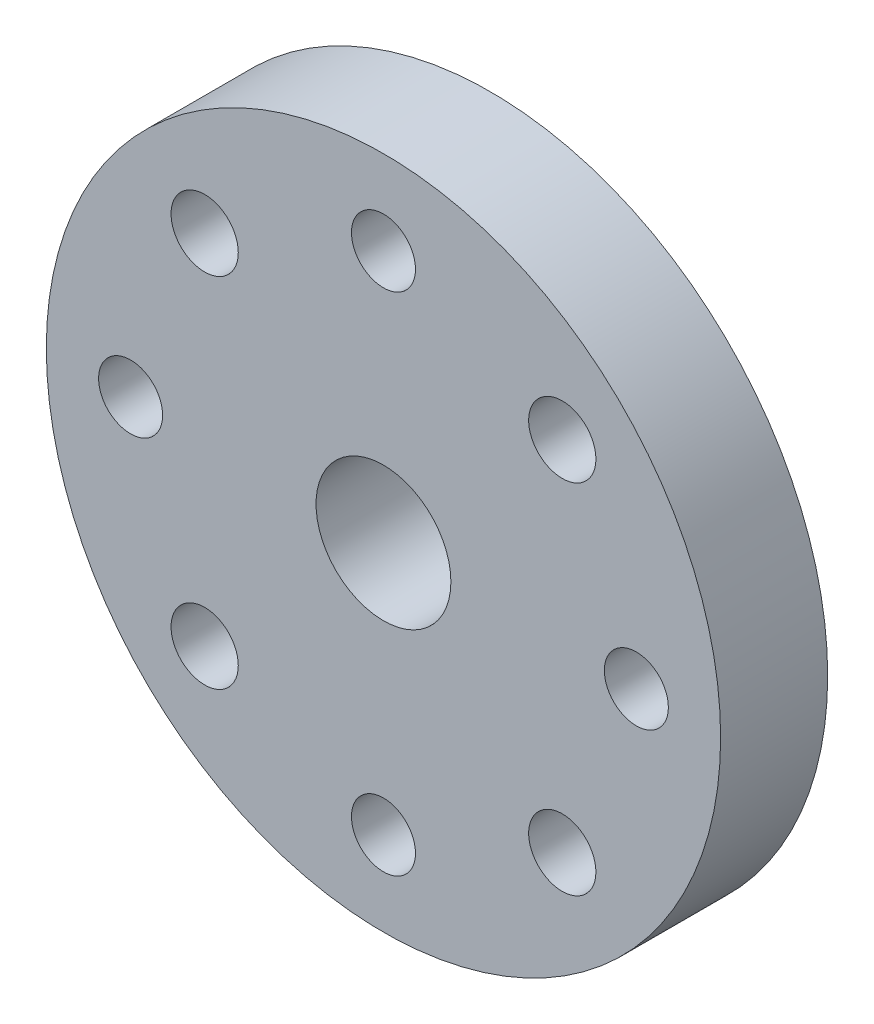
ISO-10303-21;
HEADER;
FILE_DESCRIPTION(('STEP AP214'),'2;1');
FILE_NAME('part.step','',(''),(''),'','','');
FILE_SCHEMA(('AUTOMOTIVE_DESIGN { 1 0 10303 214 1 1 1 1 }'));
ENDSEC;
DATA;
#1=APPLICATION_CONTEXT('core data for automotive mechanical design processes');
#2=APPLICATION_PROTOCOL_DEFINITION('international standard','automotive_design',2000,#1);
#3=PRODUCT_CONTEXT('',#1,'mechanical');
#4=PRODUCT('Part','Part','',(#3));
#5=PRODUCT_RELATED_PRODUCT_CATEGORY('part','',(#4));
#6=PRODUCT_DEFINITION_FORMATION('','',#4);
#7=PRODUCT_DEFINITION_CONTEXT('part definition',#1,'design');
#8=PRODUCT_DEFINITION('design','',#6,#7);
#9=PRODUCT_DEFINITION_SHAPE('','',#8);
#10=(LENGTH_UNIT() NAMED_UNIT(*) SI_UNIT(.MILLI.,.METRE.));
#11=(NAMED_UNIT(*) PLANE_ANGLE_UNIT() SI_UNIT($,.RADIAN.));
#12=(NAMED_UNIT(*) SI_UNIT($,.STERADIAN.) SOLID_ANGLE_UNIT());
#13=UNCERTAINTY_MEASURE_WITH_UNIT(LENGTH_MEASURE(1.E-05),#10,'distance_accuracy_value','');
#14=(GEOMETRIC_REPRESENTATION_CONTEXT(3) GLOBAL_UNCERTAINTY_ASSIGNED_CONTEXT((#13)) GLOBAL_UNIT_ASSIGNED_CONTEXT((#10,
#11,#12)) REPRESENTATION_CONTEXT('',''));
#15=CARTESIAN_POINT('',(0.,0.,0.));
#16=DIRECTION('',(0.,0.,1.));
#17=DIRECTION('',(1.,0.,0.));
#18=AXIS2_PLACEMENT_3D('',#15,#16,#17);
#19=CARTESIAN_POINT('',(0.,0.,6.35));
#20=DIRECTION('',(0.,0.,1.));
#21=DIRECTION('',(1.,0.,0.));
#22=AXIS2_PLACEMENT_3D('',#19,#20,#21);
#23=PLANE('',#22);
#24=CARTESIAN_POINT('',(-15.,1.57116660247941E-13,6.35));
#25=DIRECTION('',(0.,0.,1.));
#26=DIRECTION('',(1.,0.,0.));
#27=AXIS2_PLACEMENT_3D('',#24,#25,#26);
#28=CIRCLE('',#27,1.89865);
#29=CARTESIAN_POINT('',(-13.10135,1.57116660247941E-13,6.35));
#30=VERTEX_POINT('',#29);
#31=EDGE_CURVE('E85',#30,#30,#28,.T.);
#32=ORIENTED_EDGE('',*,*,#31,.F.);
#33=EDGE_LOOP('',(#32));
#34=FACE_BOUND('',#33,.T.);
#35=CARTESIAN_POINT('',(3.74802517533735E-13,-15.0000000000001,6.35));
#36=DIRECTION('',(0.,0.,1.));
#37=DIRECTION('',(1.,0.,0.));
#38=AXIS2_PLACEMENT_3D('',#35,#36,#37);
#39=CIRCLE('',#38,1.89865);
#40=CARTESIAN_POINT('',(1.89865000000037,-15.0000000000001,6.35));
#41=VERTEX_POINT('',#40);
#42=EDGE_CURVE('E73',#41,#41,#39,.T.);
#43=ORIENTED_EDGE('',*,*,#42,.F.);
#44=EDGE_LOOP('',(#43));
#45=FACE_BOUND('',#44,.T.);
#46=CARTESIAN_POINT('',(15.,0.,6.35));
#47=DIRECTION('',(0.,0.,1.));
#48=DIRECTION('',(1.,0.,0.));
#49=AXIS2_PLACEMENT_3D('',#46,#47,#48);
#50=CIRCLE('',#49,1.89865);
#51=CARTESIAN_POINT('',(16.89865,0.,6.35));
#52=VERTEX_POINT('',#51);
#53=EDGE_CURVE('E61',#52,#52,#50,.T.);
#54=ORIENTED_EDGE('',*,*,#53,.F.);
#55=EDGE_LOOP('',(#54));
#56=FACE_BOUND('',#55,.T.);
#57=CARTESIAN_POINT('',(0.,15.,6.35));
#58=DIRECTION('',(0.,0.,1.));
#59=DIRECTION('',(1.,0.,0.));
#60=AXIS2_PLACEMENT_3D('',#57,#58,#59);
#61=CIRCLE('',#60,1.89865);
#62=CARTESIAN_POINT('',(1.89865,15.,6.35));
#63=VERTEX_POINT('',#62);
#64=EDGE_CURVE('E49',#63,#63,#61,.T.);
#65=ORIENTED_EDGE('',*,*,#64,.F.);
#66=EDGE_LOOP('',(#65));
#67=FACE_BOUND('',#66,.T.);
#68=CARTESIAN_POINT('',(0.,0.,6.35));
#69=DIRECTION('',(0.,0.,1.));
#70=DIRECTION('',(1.,0.,0.));
#71=AXIS2_PLACEMENT_3D('',#68,#69,#70);
#72=CIRCLE('',#71,20.);
#73=CARTESIAN_POINT('',(20.,0.,6.35));
#74=VERTEX_POINT('',#73);
#75=EDGE_CURVE('E10',#74,#74,#72,.T.);
#76=ORIENTED_EDGE('',*,*,#75,.T.);
#77=EDGE_LOOP('',(#76));
#78=FACE_BOUND('',#77,.T.);
#79=CARTESIAN_POINT('',(0.,0.,6.35));
#80=DIRECTION('',(0.,0.,1.));
#81=DIRECTION('',(1.,0.,0.));
#82=AXIS2_PLACEMENT_3D('',#79,#80,#81);
#83=CIRCLE('',#82,4.);
#84=CARTESIAN_POINT('',(4.,0.,6.35));
#85=VERTEX_POINT('',#84);
#86=EDGE_CURVE('E44',#85,#85,#83,.T.);
#87=ORIENTED_EDGE('',*,*,#86,.F.);
#88=EDGE_LOOP('',(#87));
#89=FACE_BOUND('',#88,.T.);
#90=CARTESIAN_POINT('',(10.6066017177982,10.6066017177982,6.35));
#91=DIRECTION('',(0.,0.,1.));
#92=DIRECTION('',(1.,0.,0.));
#93=AXIS2_PLACEMENT_3D('',#90,#91,#92);
#94=CIRCLE('',#93,1.9939);
#95=CARTESIAN_POINT('',(12.6005017177982,10.6066017177982,6.35));
#96=VERTEX_POINT('',#95);
#97=EDGE_CURVE('E55',#96,#96,#94,.T.);
#98=ORIENTED_EDGE('',*,*,#97,.F.);
#99=EDGE_LOOP('',(#98));
#100=FACE_BOUND('',#99,.T.);
#101=CARTESIAN_POINT('',(10.6066017177982,-10.6066017177983,6.35));
#102=DIRECTION('',(0.,0.,1.));
#103=DIRECTION('',(1.,0.,0.));
#104=AXIS2_PLACEMENT_3D('',#101,#102,#103);
#105=CIRCLE('',#104,1.9939);
#106=CARTESIAN_POINT('',(12.6005017177982,-10.6066017177983,6.35));
#107=VERTEX_POINT('',#106);
#108=EDGE_CURVE('E67',#107,#107,#105,.T.);
#109=ORIENTED_EDGE('',*,*,#108,.F.);
#110=EDGE_LOOP('',(#109));
#111=FACE_BOUND('',#110,.T.);
#112=CARTESIAN_POINT('',(-10.6066017177979,-10.6066017177983,6.35));
#113=DIRECTION('',(0.,0.,1.));
#114=DIRECTION('',(1.,0.,0.));
#115=AXIS2_PLACEMENT_3D('',#112,#113,#114);
#116=CIRCLE('',#115,1.9939);
#117=CARTESIAN_POINT('',(-8.61270171779786,-10.6066017177983,6.35));
#118=VERTEX_POINT('',#117);
#119=EDGE_CURVE('E79',#118,#118,#116,.T.);
#120=ORIENTED_EDGE('',*,*,#119,.F.);
#121=EDGE_LOOP('',(#120));
#122=FACE_BOUND('',#121,.T.);
#123=CARTESIAN_POINT('',(-10.6066017177981,10.6066017177983,6.35));
#124=DIRECTION('',(0.,0.,1.));
#125=DIRECTION('',(1.,0.,0.));
#126=AXIS2_PLACEMENT_3D('',#123,#124,#125);
#127=CIRCLE('',#126,1.9939);
#128=CARTESIAN_POINT('',(-8.61270171779808,10.6066017177983,6.35));
#129=VERTEX_POINT('',#128);
#130=EDGE_CURVE('E91',#129,#129,#127,.T.);
#131=ORIENTED_EDGE('',*,*,#130,.F.);
#132=EDGE_LOOP('',(#131));
#133=FACE_BOUND('',#132,.T.);
#134=ADVANCED_FACE('F33',(#34,#45,#56,#67,#78,#89,#100,#111,#122,#133),#23,.T.);
#135=CARTESIAN_POINT('',(0.,0.,0.));
#136=DIRECTION('',(0.,0.,1.));
#137=DIRECTION('',(1.,0.,0.));
#138=AXIS2_PLACEMENT_3D('',#135,#136,#137);
#139=PLANE('',#138);
#140=CARTESIAN_POINT('',(0.,0.,0.));
#141=DIRECTION('',(0.,0.,1.));
#142=DIRECTION('',(1.,0.,0.));
#143=AXIS2_PLACEMENT_3D('',#140,#141,#142);
#144=CIRCLE('',#143,20.);
#145=CARTESIAN_POINT('',(20.,0.,0.));
#146=VERTEX_POINT('',#145);
#147=EDGE_CURVE('E37',#146,#146,#144,.T.);
#148=ORIENTED_EDGE('',*,*,#147,.F.);
#149=EDGE_LOOP('',(#148));
#150=FACE_BOUND('',#149,.T.);
#151=CARTESIAN_POINT('',(0.,0.,0.));
#152=DIRECTION('',(0.,0.,1.));
#153=DIRECTION('',(1.,0.,0.));
#154=AXIS2_PLACEMENT_3D('',#151,#152,#153);
#155=CIRCLE('',#154,4.);
#156=CARTESIAN_POINT('',(4.,0.,0.));
#157=VERTEX_POINT('',#156);
#158=EDGE_CURVE('E46',#157,#157,#155,.T.);
#159=ORIENTED_EDGE('',*,*,#158,.T.);
#160=EDGE_LOOP('',(#159));
#161=FACE_BOUND('',#160,.T.);
#162=CARTESIAN_POINT('',(0.,15.,0.));
#163=DIRECTION('',(0.,0.,1.));
#164=DIRECTION('',(1.,0.,0.));
#165=AXIS2_PLACEMENT_3D('',#162,#163,#164);
#166=CIRCLE('',#165,1.89865);
#167=CARTESIAN_POINT('',(1.89865,15.,0.));
#168=VERTEX_POINT('',#167);
#169=EDGE_CURVE('E52',#168,#168,#166,.T.);
#170=ORIENTED_EDGE('',*,*,#169,.T.);
#171=EDGE_LOOP('',(#170));
#172=FACE_BOUND('',#171,.T.);
#173=CARTESIAN_POINT('',(10.6066017177982,10.6066017177982,0.));
#174=DIRECTION('',(0.,0.,1.));
#175=DIRECTION('',(1.,0.,0.));
#176=AXIS2_PLACEMENT_3D('',#173,#174,#175);
#177=CIRCLE('',#176,1.9939);
#178=CARTESIAN_POINT('',(12.6005017177982,10.6066017177982,0.));
#179=VERTEX_POINT('',#178);
#180=EDGE_CURVE('E58',#179,#179,#177,.T.);
#181=ORIENTED_EDGE('',*,*,#180,.T.);
#182=EDGE_LOOP('',(#181));
#183=FACE_BOUND('',#182,.T.);
#184=CARTESIAN_POINT('',(15.,0.,0.));
#185=DIRECTION('',(0.,0.,1.));
#186=DIRECTION('',(1.,0.,0.));
#187=AXIS2_PLACEMENT_3D('',#184,#185,#186);
#188=CIRCLE('',#187,1.89865);
#189=CARTESIAN_POINT('',(16.89865,0.,0.));
#190=VERTEX_POINT('',#189);
#191=EDGE_CURVE('E64',#190,#190,#188,.T.);
#192=ORIENTED_EDGE('',*,*,#191,.T.);
#193=EDGE_LOOP('',(#192));
#194=FACE_BOUND('',#193,.T.);
#195=CARTESIAN_POINT('',(10.6066017177982,-10.6066017177983,0.));
#196=DIRECTION('',(0.,0.,1.));
#197=DIRECTION('',(1.,0.,0.));
#198=AXIS2_PLACEMENT_3D('',#195,#196,#197);
#199=CIRCLE('',#198,1.9939);
#200=CARTESIAN_POINT('',(12.6005017177982,-10.6066017177983,0.));
#201=VERTEX_POINT('',#200);
#202=EDGE_CURVE('E70',#201,#201,#199,.T.);
#203=ORIENTED_EDGE('',*,*,#202,.T.);
#204=EDGE_LOOP('',(#203));
#205=FACE_BOUND('',#204,.T.);
#206=CARTESIAN_POINT('',(3.74802517533735E-13,-15.0000000000001,0.));
#207=DIRECTION('',(0.,0.,1.));
#208=DIRECTION('',(1.,0.,0.));
#209=AXIS2_PLACEMENT_3D('',#206,#207,#208);
#210=CIRCLE('',#209,1.89865);
#211=CARTESIAN_POINT('',(1.89865000000037,-15.0000000000001,0.));
#212=VERTEX_POINT('',#211);
#213=EDGE_CURVE('E76',#212,#212,#210,.T.);
#214=ORIENTED_EDGE('',*,*,#213,.T.);
#215=EDGE_LOOP('',(#214));
#216=FACE_BOUND('',#215,.T.);
#217=CARTESIAN_POINT('',(-10.6066017177979,-10.6066017177983,0.));
#218=DIRECTION('',(0.,0.,1.));
#219=DIRECTION('',(1.,0.,0.));
#220=AXIS2_PLACEMENT_3D('',#217,#218,#219);
#221=CIRCLE('',#220,1.9939);
#222=CARTESIAN_POINT('',(-8.61270171779786,-10.6066017177983,0.));
#223=VERTEX_POINT('',#222);
#224=EDGE_CURVE('E82',#223,#223,#221,.T.);
#225=ORIENTED_EDGE('',*,*,#224,.T.);
#226=EDGE_LOOP('',(#225));
#227=FACE_BOUND('',#226,.T.);
#228=CARTESIAN_POINT('',(-15.,1.57116660247941E-13,0.));
#229=DIRECTION('',(0.,0.,1.));
#230=DIRECTION('',(1.,0.,0.));
#231=AXIS2_PLACEMENT_3D('',#228,#229,#230);
#232=CIRCLE('',#231,1.89865);
#233=CARTESIAN_POINT('',(-13.10135,1.57116660247941E-13,0.));
#234=VERTEX_POINT('',#233);
#235=EDGE_CURVE('E88',#234,#234,#232,.T.);
#236=ORIENTED_EDGE('',*,*,#235,.T.);
#237=EDGE_LOOP('',(#236));
#238=FACE_BOUND('',#237,.T.);
#239=CARTESIAN_POINT('',(-10.6066017177981,10.6066017177983,0.));
#240=DIRECTION('',(0.,0.,1.));
#241=DIRECTION('',(1.,0.,0.));
#242=AXIS2_PLACEMENT_3D('',#239,#240,#241);
#243=CIRCLE('',#242,1.9939);
#244=CARTESIAN_POINT('',(-8.61270171779808,10.6066017177983,0.));
#245=VERTEX_POINT('',#244);
#246=EDGE_CURVE('E94',#245,#245,#243,.T.);
#247=ORIENTED_EDGE('',*,*,#246,.T.);
#248=EDGE_LOOP('',(#247));
#249=FACE_BOUND('',#248,.T.);
#250=ADVANCED_FACE('F104',(#150,#161,#172,#183,#194,#205,#216,#227,#238,#249),#139,.F.);
#251=CARTESIAN_POINT('',(0.,0.,6.35));
#252=DIRECTION('',(0.,0.,-1.));
#253=DIRECTION('',(-1.,0.,0.));
#254=AXIS2_PLACEMENT_3D('',#251,#252,#253);
#255=CYLINDRICAL_SURFACE('',#254,20.);
#256=ORIENTED_EDGE('',*,*,#75,.F.);
#257=EDGE_LOOP('',(#256));
#258=FACE_BOUND('',#257,.T.);
#259=ORIENTED_EDGE('',*,*,#147,.T.);
#260=EDGE_LOOP('',(#259));
#261=FACE_BOUND('',#260,.T.);
#262=ADVANCED_FACE('F35',(#258,#261),#255,.T.);
#263=CARTESIAN_POINT('',(0.,0.,6.35));
#264=DIRECTION('',(0.,0.,-1.));
#265=DIRECTION('',(-1.,0.,0.));
#266=AXIS2_PLACEMENT_3D('',#263,#264,#265);
#267=CYLINDRICAL_SURFACE('',#266,4.);
#268=ORIENTED_EDGE('',*,*,#86,.T.);
#269=EDGE_LOOP('',(#268));
#270=FACE_BOUND('',#269,.T.);
#271=ORIENTED_EDGE('',*,*,#158,.F.);
#272=EDGE_LOOP('',(#271));
#273=FACE_BOUND('',#272,.T.);
#274=ADVANCED_FACE('F114',(#270,#273),#267,.F.);
#275=CARTESIAN_POINT('',(0.,15.,6.35));
#276=DIRECTION('',(0.,0.,-1.));
#277=DIRECTION('',(-1.,0.,0.));
#278=AXIS2_PLACEMENT_3D('',#275,#276,#277);
#279=CYLINDRICAL_SURFACE('',#278,1.89865);
#280=ORIENTED_EDGE('',*,*,#64,.T.);
#281=EDGE_LOOP('',(#280));
#282=FACE_BOUND('',#281,.T.);
#283=ORIENTED_EDGE('',*,*,#169,.F.);
#284=EDGE_LOOP('',(#283));
#285=FACE_BOUND('',#284,.T.);
#286=ADVANCED_FACE('F117',(#282,#285),#279,.F.);
#287=CARTESIAN_POINT('',(10.6066017177982,10.6066017177982,6.35));
#288=DIRECTION('',(0.,0.,-1.));
#289=DIRECTION('',(-1.,0.,0.));
#290=AXIS2_PLACEMENT_3D('',#287,#288,#289);
#291=CYLINDRICAL_SURFACE('',#290,1.9939);
#292=ORIENTED_EDGE('',*,*,#97,.T.);
#293=EDGE_LOOP('',(#292));
#294=FACE_BOUND('',#293,.T.);
#295=ORIENTED_EDGE('',*,*,#180,.F.);
#296=EDGE_LOOP('',(#295));
#297=FACE_BOUND('',#296,.T.);
#298=ADVANCED_FACE('F121',(#294,#297),#291,.F.);
#299=CARTESIAN_POINT('',(15.,0.,6.35));
#300=DIRECTION('',(0.,0.,-1.));
#301=DIRECTION('',(-1.,0.,0.));
#302=AXIS2_PLACEMENT_3D('',#299,#300,#301);
#303=CYLINDRICAL_SURFACE('',#302,1.89865);
#304=ORIENTED_EDGE('',*,*,#53,.T.);
#305=EDGE_LOOP('',(#304));
#306=FACE_BOUND('',#305,.T.);
#307=ORIENTED_EDGE('',*,*,#191,.F.);
#308=EDGE_LOOP('',(#307));
#309=FACE_BOUND('',#308,.T.);
#310=ADVANCED_FACE('F125',(#306,#309),#303,.F.);
#311=CARTESIAN_POINT('',(10.6066017177982,-10.6066017177983,6.35));
#312=DIRECTION('',(0.,0.,-1.));
#313=DIRECTION('',(-1.,0.,0.));
#314=AXIS2_PLACEMENT_3D('',#311,#312,#313);
#315=CYLINDRICAL_SURFACE('',#314,1.9939);
#316=ORIENTED_EDGE('',*,*,#108,.T.);
#317=EDGE_LOOP('',(#316));
#318=FACE_BOUND('',#317,.T.);
#319=ORIENTED_EDGE('',*,*,#202,.F.);
#320=EDGE_LOOP('',(#319));
#321=FACE_BOUND('',#320,.T.);
#322=ADVANCED_FACE('F129',(#318,#321),#315,.F.);
#323=CARTESIAN_POINT('',(3.74802517533735E-13,-15.0000000000001,6.35));
#324=DIRECTION('',(0.,0.,-1.));
#325=DIRECTION('',(-1.,0.,0.));
#326=AXIS2_PLACEMENT_3D('',#323,#324,#325);
#327=CYLINDRICAL_SURFACE('',#326,1.89865);
#328=ORIENTED_EDGE('',*,*,#42,.T.);
#329=EDGE_LOOP('',(#328));
#330=FACE_BOUND('',#329,.T.);
#331=ORIENTED_EDGE('',*,*,#213,.F.);
#332=EDGE_LOOP('',(#331));
#333=FACE_BOUND('',#332,.T.);
#334=ADVANCED_FACE('F133',(#330,#333),#327,.F.);
#335=CARTESIAN_POINT('',(-10.6066017177979,-10.6066017177983,6.35));
#336=DIRECTION('',(0.,0.,-1.));
#337=DIRECTION('',(-1.,0.,0.));
#338=AXIS2_PLACEMENT_3D('',#335,#336,#337);
#339=CYLINDRICAL_SURFACE('',#338,1.9939);
#340=ORIENTED_EDGE('',*,*,#119,.T.);
#341=EDGE_LOOP('',(#340));
#342=FACE_BOUND('',#341,.T.);
#343=ORIENTED_EDGE('',*,*,#224,.F.);
#344=EDGE_LOOP('',(#343));
#345=FACE_BOUND('',#344,.T.);
#346=ADVANCED_FACE('F137',(#342,#345),#339,.F.);
#347=CARTESIAN_POINT('',(-15.,1.57116660247941E-13,6.35));
#348=DIRECTION('',(0.,0.,-1.));
#349=DIRECTION('',(-1.,0.,0.));
#350=AXIS2_PLACEMENT_3D('',#347,#348,#349);
#351=CYLINDRICAL_SURFACE('',#350,1.89865);
#352=ORIENTED_EDGE('',*,*,#31,.T.);
#353=EDGE_LOOP('',(#352));
#354=FACE_BOUND('',#353,.T.);
#355=ORIENTED_EDGE('',*,*,#235,.F.);
#356=EDGE_LOOP('',(#355));
#357=FACE_BOUND('',#356,.T.);
#358=ADVANCED_FACE('F141',(#354,#357),#351,.F.);
#359=CARTESIAN_POINT('',(-10.6066017177981,10.6066017177983,6.35));
#360=DIRECTION('',(0.,0.,-1.));
#361=DIRECTION('',(-1.,0.,0.));
#362=AXIS2_PLACEMENT_3D('',#359,#360,#361);
#363=CYLINDRICAL_SURFACE('',#362,1.9939);
#364=ORIENTED_EDGE('',*,*,#130,.T.);
#365=EDGE_LOOP('',(#364));
#366=FACE_BOUND('',#365,.T.);
#367=ORIENTED_EDGE('',*,*,#246,.F.);
#368=EDGE_LOOP('',(#367));
#369=FACE_BOUND('',#368,.T.);
#370=ADVANCED_FACE('F100',(#366,#369),#363,.F.);
#371=CLOSED_SHELL('',(#134,#250,#262,#274,#286,#298,#310,#322,#334,#346,#358,#370));
#372=MANIFOLD_SOLID_BREP('B2',#371);
#373=ADVANCED_BREP_SHAPE_REPRESENTATION('',(#18,#372),#14);
#374=SHAPE_DEFINITION_REPRESENTATION(#9,#373);
ENDSEC;
END-ISO-10303-21;
